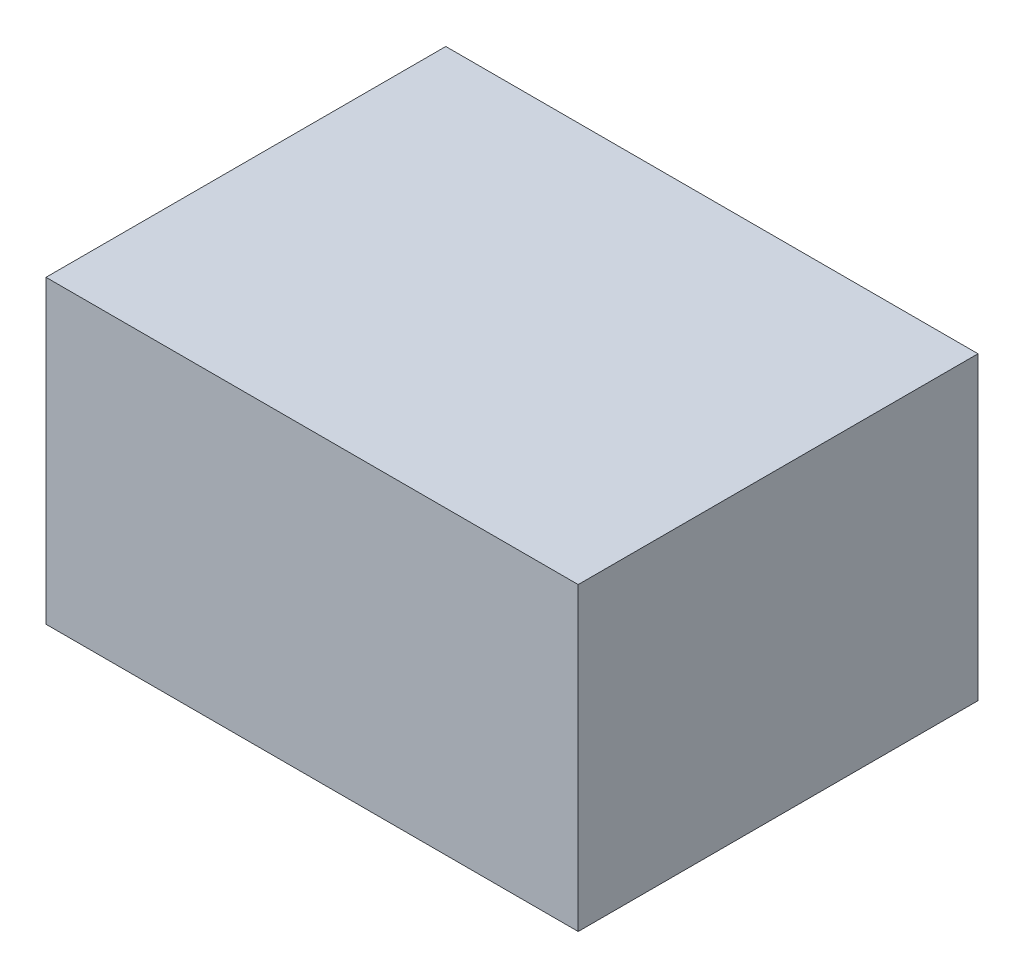
ISO-10303-21;
HEADER;
FILE_DESCRIPTION(('STEP AP214'),'2;1');
FILE_NAME('part.step','',(''),(''),'','','');
FILE_SCHEMA(('AUTOMOTIVE_DESIGN { 1 0 10303 214 1 1 1 1 }'));
ENDSEC;
DATA;
#1=APPLICATION_CONTEXT('core data for automotive mechanical design processes');
#2=APPLICATION_PROTOCOL_DEFINITION('international standard','automotive_design',2000,#1);
#3=PRODUCT_CONTEXT('',#1,'mechanical');
#4=PRODUCT('Part','Part','',(#3));
#5=PRODUCT_RELATED_PRODUCT_CATEGORY('part','',(#4));
#6=PRODUCT_DEFINITION_FORMATION('','',#4);
#7=PRODUCT_DEFINITION_CONTEXT('part definition',#1,'design');
#8=PRODUCT_DEFINITION('design','',#6,#7);
#9=PRODUCT_DEFINITION_SHAPE('','',#8);
#10=(LENGTH_UNIT() NAMED_UNIT(*) SI_UNIT(.MILLI.,.METRE.));
#11=(NAMED_UNIT(*) PLANE_ANGLE_UNIT() SI_UNIT($,.RADIAN.));
#12=(NAMED_UNIT(*) SI_UNIT($,.STERADIAN.) SOLID_ANGLE_UNIT());
#13=UNCERTAINTY_MEASURE_WITH_UNIT(LENGTH_MEASURE(1.E-05),#10,'distance_accuracy_value','');
#14=(GEOMETRIC_REPRESENTATION_CONTEXT(3) GLOBAL_UNCERTAINTY_ASSIGNED_CONTEXT((#13)) GLOBAL_UNIT_ASSIGNED_CONTEXT((#10,
#11,#12)) REPRESENTATION_CONTEXT('',''));
#15=CARTESIAN_POINT('',(0.,0.,0.));
#16=DIRECTION('',(0.,0.,1.));
#17=DIRECTION('',(1.,0.,0.));
#18=AXIS2_PLACEMENT_3D('',#15,#16,#17);
#19=CARTESIAN_POINT('',(53.086,29.972,39.878));
#20=DIRECTION('',(1.,0.,0.));
#21=DIRECTION('',(0.,0.,-1.));
#22=AXIS2_PLACEMENT_3D('',#19,#20,#21);
#23=PLANE('',#22);
#24=DIRECTION('',(0.,-1.,0.));
#25=VECTOR('',#24,1.);
#26=CARTESIAN_POINT('',(53.086,29.972,0.));
#27=LINE('',#26,#25);
#28=CARTESIAN_POINT('',(53.086,29.972,0.));
#29=VERTEX_POINT('',#28);
#30=CARTESIAN_POINT('',(53.086,0.,0.));
#31=VERTEX_POINT('',#30);
#32=EDGE_CURVE('E67',#29,#31,#27,.T.);
#33=ORIENTED_EDGE('',*,*,#32,.F.);
#34=DIRECTION('',(0.,0.,-1.));
#35=VECTOR('',#34,1.);
#36=CARTESIAN_POINT('',(53.086,29.972,39.878));
#37=LINE('',#36,#35);
#38=CARTESIAN_POINT('',(53.086,29.972,39.878));
#39=VERTEX_POINT('',#38);
#40=EDGE_CURVE('E19',#39,#29,#37,.T.);
#41=ORIENTED_EDGE('',*,*,#40,.F.);
#42=DIRECTION('',(0.,-1.,0.));
#43=VECTOR('',#42,1.);
#44=CARTESIAN_POINT('',(53.086,29.972,39.878));
#45=LINE('',#44,#43);
#46=CARTESIAN_POINT('',(53.086,0.,39.878));
#47=VERTEX_POINT('',#46);
#48=EDGE_CURVE('E69',#39,#47,#45,.T.);
#49=ORIENTED_EDGE('',*,*,#48,.T.);
#50=DIRECTION('',(0.,0.,-1.));
#51=VECTOR('',#50,1.);
#52=CARTESIAN_POINT('',(53.086,0.,39.878));
#53=LINE('',#52,#51);
#54=EDGE_CURVE('E11',#47,#31,#53,.T.);
#55=ORIENTED_EDGE('',*,*,#54,.T.);
#56=EDGE_LOOP('',(#33,#41,#49,#55));
#57=FACE_BOUND('',#56,.T.);
#58=ADVANCED_FACE('F16',(#57),#23,.T.);
#59=CARTESIAN_POINT('',(53.086,0.,39.878));
#60=DIRECTION('',(0.,-1.,0.));
#61=DIRECTION('',(0.,0.,-1.));
#62=AXIS2_PLACEMENT_3D('',#59,#60,#61);
#63=PLANE('',#62);
#64=DIRECTION('',(-1.,0.,0.));
#65=VECTOR('',#64,1.);
#66=CARTESIAN_POINT('',(53.086,0.,0.));
#67=LINE('',#66,#65);
#68=CARTESIAN_POINT('',(0.,0.,0.));
#69=VERTEX_POINT('',#68);
#70=EDGE_CURVE('E72',#31,#69,#67,.T.);
#71=ORIENTED_EDGE('',*,*,#70,.F.);
#72=ORIENTED_EDGE('',*,*,#54,.F.);
#73=DIRECTION('',(-1.,0.,0.));
#74=VECTOR('',#73,1.);
#75=CARTESIAN_POINT('',(53.086,0.,39.878));
#76=LINE('',#75,#74);
#77=CARTESIAN_POINT('',(0.,0.,39.878));
#78=VERTEX_POINT('',#77);
#79=EDGE_CURVE('E78',#47,#78,#76,.T.);
#80=ORIENTED_EDGE('',*,*,#79,.T.);
#81=DIRECTION('',(0.,0.,-1.));
#82=VECTOR('',#81,1.);
#83=CARTESIAN_POINT('',(0.,0.,39.878));
#84=LINE('',#83,#82);
#85=EDGE_CURVE('E24',#78,#69,#84,.T.);
#86=ORIENTED_EDGE('',*,*,#85,.T.);
#87=EDGE_LOOP('',(#71,#72,#80,#86));
#88=FACE_BOUND('',#87,.T.);
#89=ADVANCED_FACE('F85',(#88),#63,.T.);
#90=CARTESIAN_POINT('',(0.,0.,39.878));
#91=DIRECTION('',(-1.,0.,0.));
#92=DIRECTION('',(0.,0.,1.));
#93=AXIS2_PLACEMENT_3D('',#90,#91,#92);
#94=PLANE('',#93);
#95=DIRECTION('',(0.,1.,0.));
#96=VECTOR('',#95,1.);
#97=CARTESIAN_POINT('',(0.,0.,0.));
#98=LINE('',#97,#96);
#99=CARTESIAN_POINT('',(0.,29.972,0.));
#100=VERTEX_POINT('',#99);
#101=EDGE_CURVE('E68',#69,#100,#98,.T.);
#102=ORIENTED_EDGE('',*,*,#101,.F.);
#103=ORIENTED_EDGE('',*,*,#85,.F.);
#104=DIRECTION('',(0.,1.,0.));
#105=VECTOR('',#104,1.);
#106=CARTESIAN_POINT('',(0.,0.,39.878));
#107=LINE('',#106,#105);
#108=CARTESIAN_POINT('',(0.,29.972,39.878));
#109=VERTEX_POINT('',#108);
#110=EDGE_CURVE('E80',#78,#109,#107,.T.);
#111=ORIENTED_EDGE('',*,*,#110,.T.);
#112=DIRECTION('',(0.,0.,-1.));
#113=VECTOR('',#112,1.);
#114=CARTESIAN_POINT('',(0.,29.972,39.878));
#115=LINE('',#114,#113);
#116=EDGE_CURVE('E31',#109,#100,#115,.T.);
#117=ORIENTED_EDGE('',*,*,#116,.T.);
#118=EDGE_LOOP('',(#102,#103,#111,#117));
#119=FACE_BOUND('',#118,.T.);
#120=ADVANCED_FACE('F88',(#119),#94,.T.);
#121=CARTESIAN_POINT('',(0.,29.972,39.878));
#122=DIRECTION('',(0.,1.,0.));
#123=DIRECTION('',(0.,0.,1.));
#124=AXIS2_PLACEMENT_3D('',#121,#122,#123);
#125=PLANE('',#124);
#126=DIRECTION('',(1.,0.,0.));
#127=VECTOR('',#126,1.);
#128=CARTESIAN_POINT('',(0.,29.972,0.));
#129=LINE('',#128,#127);
#130=EDGE_CURVE('E55',#100,#29,#129,.T.);
#131=ORIENTED_EDGE('',*,*,#130,.F.);
#132=ORIENTED_EDGE('',*,*,#116,.F.);
#133=DIRECTION('',(1.,0.,0.));
#134=VECTOR('',#133,1.);
#135=CARTESIAN_POINT('',(0.,29.972,39.878));
#136=LINE('',#135,#134);
#137=EDGE_CURVE('E58',#109,#39,#136,.T.);
#138=ORIENTED_EDGE('',*,*,#137,.T.);
#139=ORIENTED_EDGE('',*,*,#40,.T.);
#140=EDGE_LOOP('',(#131,#132,#138,#139));
#141=FACE_BOUND('',#140,.T.);
#142=ADVANCED_FACE('F54',(#141),#125,.T.);
#143=CARTESIAN_POINT('',(53.086,0.,39.878));
#144=DIRECTION('',(0.,0.,-1.));
#145=DIRECTION('',(-1.,0.,0.));
#146=AXIS2_PLACEMENT_3D('',#143,#144,#145);
#147=PLANE('',#146);
#148=ORIENTED_EDGE('',*,*,#48,.F.);
#149=ORIENTED_EDGE('',*,*,#137,.F.);
#150=ORIENTED_EDGE('',*,*,#110,.F.);
#151=ORIENTED_EDGE('',*,*,#79,.F.);
#152=EDGE_LOOP('',(#148,#149,#150,#151));
#153=FACE_BOUND('',#152,.T.);
#154=ADVANCED_FACE('F90',(#153),#147,.F.);
#155=CARTESIAN_POINT('',(53.086,0.,0.));
#156=DIRECTION('',(0.,0.,-1.));
#157=DIRECTION('',(-1.,0.,0.));
#158=AXIS2_PLACEMENT_3D('',#155,#156,#157);
#159=PLANE('',#158);
#160=ORIENTED_EDGE('',*,*,#32,.T.);
#161=ORIENTED_EDGE('',*,*,#70,.T.);
#162=ORIENTED_EDGE('',*,*,#101,.T.);
#163=ORIENTED_EDGE('',*,*,#130,.T.);
#164=EDGE_LOOP('',(#160,#161,#162,#163));
#165=FACE_BOUND('',#164,.T.);
#166=ADVANCED_FACE('F65',(#165),#159,.T.);
#167=CLOSED_SHELL('',(#58,#89,#120,#142,#154,#166));
#168=MANIFOLD_SOLID_BREP('B1',#167);
#169=ADVANCED_BREP_SHAPE_REPRESENTATION('',(#18,#168),#14);
#170=SHAPE_DEFINITION_REPRESENTATION(#9,#169);
ENDSEC;
END-ISO-10303-21;
